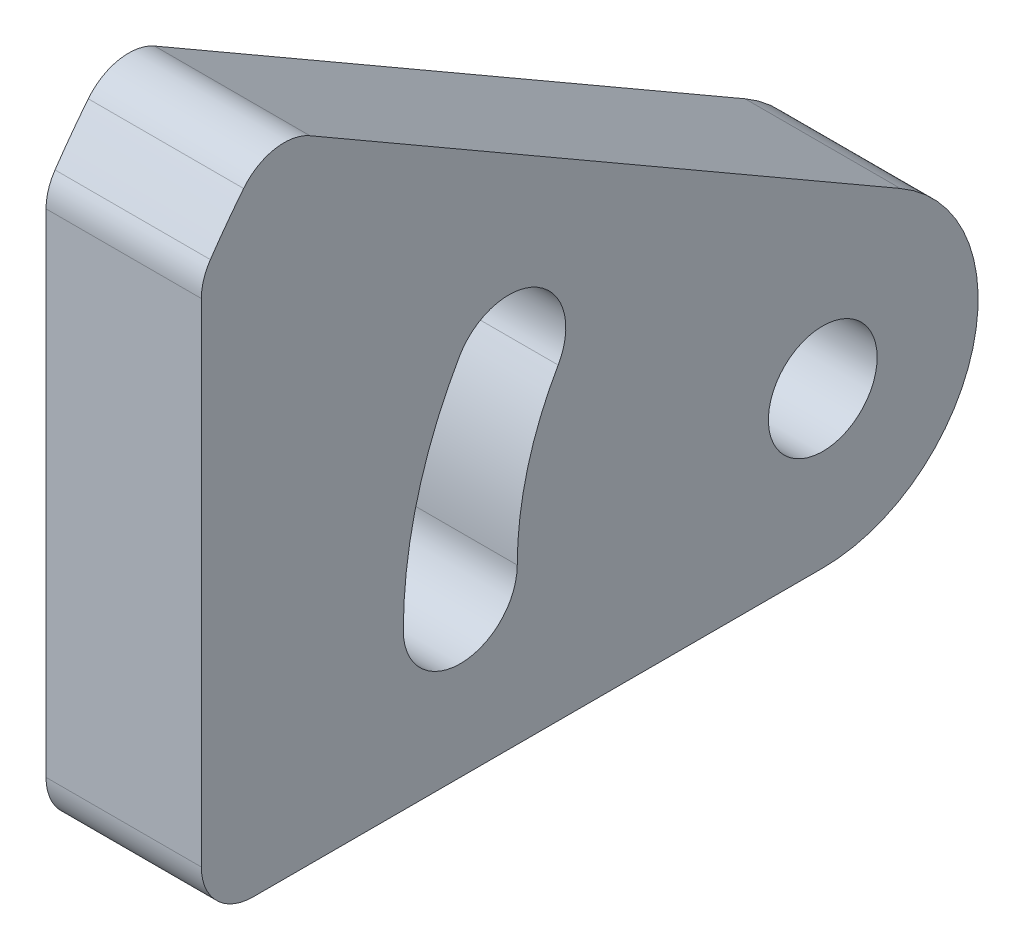
ISO-10303-21;
HEADER;
FILE_DESCRIPTION(('STEP AP214'),'2;1');
FILE_NAME('part.step','',(''),(''),'','','');
FILE_SCHEMA(('AUTOMOTIVE_DESIGN { 1 0 10303 214 1 1 1 1 }'));
ENDSEC;
DATA;
#1=APPLICATION_CONTEXT('core data for automotive mechanical design processes');
#2=APPLICATION_PROTOCOL_DEFINITION('international standard','automotive_design',2000,#1);
#3=PRODUCT_CONTEXT('',#1,'mechanical');
#4=PRODUCT('Part','Part','',(#3));
#5=PRODUCT_RELATED_PRODUCT_CATEGORY('part','',(#4));
#6=PRODUCT_DEFINITION_FORMATION('','',#4);
#7=PRODUCT_DEFINITION_CONTEXT('part definition',#1,'design');
#8=PRODUCT_DEFINITION('design','',#6,#7);
#9=PRODUCT_DEFINITION_SHAPE('','',#8);
#10=(LENGTH_UNIT() NAMED_UNIT(*) SI_UNIT(.MILLI.,.METRE.));
#11=(NAMED_UNIT(*) PLANE_ANGLE_UNIT() SI_UNIT($,.RADIAN.));
#12=(NAMED_UNIT(*) SI_UNIT($,.STERADIAN.) SOLID_ANGLE_UNIT());
#13=UNCERTAINTY_MEASURE_WITH_UNIT(LENGTH_MEASURE(1.E-05),#10,'distance_accuracy_value','');
#14=(GEOMETRIC_REPRESENTATION_CONTEXT(3) GLOBAL_UNCERTAINTY_ASSIGNED_CONTEXT((#13)) GLOBAL_UNIT_ASSIGNED_CONTEXT((#10,
#11,#12)) REPRESENTATION_CONTEXT('',''));
#15=CARTESIAN_POINT('',(0.,0.,0.));
#16=DIRECTION('',(0.,0.,1.));
#17=DIRECTION('',(1.,0.,0.));
#18=AXIS2_PLACEMENT_3D('',#15,#16,#17);
#19=CARTESIAN_POINT('',(1.5,0.,0.));
#20=DIRECTION('',(-1.,0.,0.));
#21=DIRECTION('',(0.,0.,1.));
#22=AXIS2_PLACEMENT_3D('',#19,#20,#21);
#23=CYLINDRICAL_SURFACE('',#22,14.3178210632764);
#24=CARTESIAN_POINT('',(1.5,0.,0.));
#25=DIRECTION('',(1.,0.,0.));
#26=DIRECTION('',(0.,0.,-1.));
#27=AXIS2_PLACEMENT_3D('',#24,#25,#26);
#28=CIRCLE('',#27,14.3178210632764);
#29=CARTESIAN_POINT('',(1.5,8.93983064408773,11.1838914540079));
#30=VERTEX_POINT('',#29);
#31=CARTESIAN_POINT('',(1.5,8.07134733814683,11.8259609396865));
#32=VERTEX_POINT('',#31);
#33=EDGE_CURVE('E182',#30,#32,#28,.T.);
#34=ORIENTED_EDGE('',*,*,#33,.F.);
#35=DIRECTION('',(-1.,0.,0.));
#36=VECTOR('',#35,1.);
#37=CARTESIAN_POINT('',(1.5,8.93983064408773,11.1838914540079));
#38=LINE('',#37,#36);
#39=CARTESIAN_POINT('',(-1.5,8.93983064408773,11.1838914540079));
#40=VERTEX_POINT('',#39);
#41=EDGE_CURVE('E204',#30,#40,#38,.T.);
#42=ORIENTED_EDGE('',*,*,#41,.T.);
#43=CARTESIAN_POINT('',(-1.5,0.,0.));
#44=DIRECTION('',(1.,0.,0.));
#45=DIRECTION('',(0.,0.,-1.));
#46=AXIS2_PLACEMENT_3D('',#43,#44,#45);
#47=CIRCLE('',#46,14.3178210632764);
#48=CARTESIAN_POINT('',(-1.5,8.07134733814683,11.8259609396865));
#49=VERTEX_POINT('',#48);
#50=EDGE_CURVE('E192',#40,#49,#47,.T.);
#51=ORIENTED_EDGE('',*,*,#50,.T.);
#52=DIRECTION('',(-1.,0.,0.));
#53=VECTOR('',#52,1.);
#54=CARTESIAN_POINT('',(1.5,8.07134733814683,11.8259609396865));
#55=LINE('',#54,#53);
#56=EDGE_CURVE('E201',#49,#32,#55,.F.);
#57=ORIENTED_EDGE('',*,*,#56,.T.);
#58=EDGE_LOOP('',(#34,#42,#51,#57));
#59=FACE_BOUND('',#58,.T.);
#60=ADVANCED_FACE('F33',(#59),#23,.T.);
#61=CARTESIAN_POINT('',(1.5,0.,0.));
#62=DIRECTION('',(1.,0.,0.));
#63=DIRECTION('',(0.,0.,-1.));
#64=AXIS2_PLACEMENT_3D('',#61,#62,#63);
#65=PLANE('',#64);
#66=CARTESIAN_POINT('',(1.5,3.5,6.06217782649107));
#67=DIRECTION('',(1.,0.,0.));
#68=DIRECTION('',(0.,0.,-1.));
#69=AXIS2_PLACEMENT_3D('',#66,#67,#68);
#70=CIRCLE('',#69,1.1);
#71=CARTESIAN_POINT('',(1.5,2.95,5.10954988232819));
#72=VERTEX_POINT('',#71);
#73=CARTESIAN_POINT('',(1.5,4.05,7.01480577065395));
#74=VERTEX_POINT('',#73);
#75=EDGE_CURVE('E127',#72,#74,#70,.T.);
#76=ORIENTED_EDGE('',*,*,#75,.F.);
#77=CARTESIAN_POINT('',(1.5,0.,0.));
#78=DIRECTION('',(-1.,0.,0.));
#79=DIRECTION('',(0.,0.,-1.));
#80=AXIS2_PLACEMENT_3D('',#77,#78,#79);
#81=CIRCLE('',#80,5.9);
#82=CARTESIAN_POINT('',(1.5,0.,5.9));
#83=VERTEX_POINT('',#82);
#84=EDGE_CURVE('E145',#83,#72,#81,.T.);
#85=ORIENTED_EDGE('',*,*,#84,.F.);
#86=CARTESIAN_POINT('',(1.5,0.,7.));
#87=DIRECTION('',(1.,0.,0.));
#88=DIRECTION('',(0.,0.,-1.));
#89=AXIS2_PLACEMENT_3D('',#86,#87,#88);
#90=CIRCLE('',#89,1.1);
#91=CARTESIAN_POINT('',(1.5,0.,8.1));
#92=VERTEX_POINT('',#91);
#93=EDGE_CURVE('E148',#92,#83,#90,.T.);
#94=ORIENTED_EDGE('',*,*,#93,.F.);
#95=CARTESIAN_POINT('',(1.5,0.,0.));
#96=DIRECTION('',(1.,0.,0.));
#97=DIRECTION('',(0.,0.,-1.));
#98=AXIS2_PLACEMENT_3D('',#95,#96,#97);
#99=CIRCLE('',#98,8.1);
#100=EDGE_CURVE('E154',#74,#92,#99,.T.);
#101=ORIENTED_EDGE('',*,*,#100,.F.);
#102=EDGE_LOOP('',(#76,#85,#94,#101));
#103=FACE_BOUND('',#102,.T.);
#104=DIRECTION('',(0.,0.500000000000001,0.866025403784438));
#105=VECTOR('',#104,1.);
#106=CARTESIAN_POINT('',(1.5,2.59807621135331,-1.5));
#107=LINE('',#106,#105);
#108=CARTESIAN_POINT('',(1.5,2.59807621135331,-1.5));
#109=VERTEX_POINT('',#108);
#110=CARTESIAN_POINT('',(1.5,9.18147119178415,9.9027745924001));
#111=VERTEX_POINT('',#110);
#112=EDGE_CURVE('E178',#109,#111,#107,.T.);
#113=ORIENTED_EDGE('',*,*,#112,.T.);
#114=CARTESIAN_POINT('',(1.5,8.31544578799972,10.4027745924001));
#115=DIRECTION('',(1.,0.,0.));
#116=DIRECTION('',(0.,0.,-1.));
#117=AXIS2_PLACEMENT_3D('',#114,#115,#116);
#118=CIRCLE('',#117,1.);
#119=EDGE_CURVE('E217',#111,#30,#118,.T.);
#120=ORIENTED_EDGE('',*,*,#119,.T.);
#121=ORIENTED_EDGE('',*,*,#33,.T.);
#122=CARTESIAN_POINT('',(1.5,7.50761998728274,11.));
#123=DIRECTION('',(1.,0.,0.));
#124=DIRECTION('',(0.,0.,-1.));
#125=AXIS2_PLACEMENT_3D('',#122,#123,#124);
#126=CIRCLE('',#125,1.);
#127=CARTESIAN_POINT('',(1.5,7.50761998728274,12.));
#128=VERTEX_POINT('',#127);
#129=EDGE_CURVE('E54',#32,#128,#126,.T.);
#130=ORIENTED_EDGE('',*,*,#129,.T.);
#131=DIRECTION('',(0.,1.,0.));
#132=VECTOR('',#131,1.);
#133=CARTESIAN_POINT('',(1.5,7.81024967590666,12.));
#134=LINE('',#133,#132);
#135=CARTESIAN_POINT('',(1.5,-2.,12.));
#136=VERTEX_POINT('',#135);
#137=EDGE_CURVE('E160',#136,#128,#134,.T.);
#138=ORIENTED_EDGE('',*,*,#137,.F.);
#139=CARTESIAN_POINT('',(1.5,-2.,11.));
#140=DIRECTION('',(1.,0.,0.));
#141=DIRECTION('',(0.,0.,-1.));
#142=AXIS2_PLACEMENT_3D('',#139,#140,#141);
#143=CIRCLE('',#142,1.);
#144=CARTESIAN_POINT('',(1.5,-3.,11.));
#145=VERTEX_POINT('',#144);
#146=EDGE_CURVE('E48',#136,#145,#143,.T.);
#147=ORIENTED_EDGE('',*,*,#146,.T.);
#148=DIRECTION('',(0.,0.,-1.));
#149=VECTOR('',#148,1.);
#150=CARTESIAN_POINT('',(1.5,-3.,0.));
#151=LINE('',#150,#149);
#152=CARTESIAN_POINT('',(1.5,-3.,0.));
#153=VERTEX_POINT('',#152);
#154=EDGE_CURVE('E184',#145,#153,#151,.T.);
#155=ORIENTED_EDGE('',*,*,#154,.T.);
#156=CARTESIAN_POINT('',(1.5,0.,0.));
#157=DIRECTION('',(1.,0.,0.));
#158=DIRECTION('',(0.,0.,-1.));
#159=AXIS2_PLACEMENT_3D('',#156,#157,#158);
#160=CIRCLE('',#159,3.);
#161=EDGE_CURVE('E175',#153,#109,#160,.T.);
#162=ORIENTED_EDGE('',*,*,#161,.T.);
#163=EDGE_LOOP('',(#113,#120,#121,#130,#138,#147,#155,#162));
#164=FACE_BOUND('',#163,.T.);
#165=CARTESIAN_POINT('',(1.5,0.,0.));
#166=DIRECTION('',(1.,0.,0.));
#167=DIRECTION('',(0.,0.,-1.));
#168=AXIS2_PLACEMENT_3D('',#165,#166,#167);
#169=CIRCLE('',#168,1.05);
#170=CARTESIAN_POINT('',(1.5,0.,-1.05));
#171=VERTEX_POINT('',#170);
#172=EDGE_CURVE('E169',#171,#171,#169,.T.);
#173=ORIENTED_EDGE('',*,*,#172,.F.);
#174=EDGE_LOOP('',(#173));
#175=FACE_BOUND('',#174,.T.);
#176=ADVANCED_FACE('F237',(#103,#164,#175),#65,.T.);
#177=CARTESIAN_POINT('',(-1.5,0.,0.));
#178=DIRECTION('',(1.,0.,0.));
#179=DIRECTION('',(0.,0.,-1.));
#180=AXIS2_PLACEMENT_3D('',#177,#178,#179);
#181=PLANE('',#180);
#182=CARTESIAN_POINT('',(-1.5,0.,0.));
#183=DIRECTION('',(-1.,0.,0.));
#184=DIRECTION('',(0.,0.,-1.));
#185=AXIS2_PLACEMENT_3D('',#182,#183,#184);
#186=CIRCLE('',#185,5.9);
#187=CARTESIAN_POINT('',(-1.5,0.,5.9));
#188=VERTEX_POINT('',#187);
#189=CARTESIAN_POINT('',(-1.5,2.95,5.10954988232819));
#190=VERTEX_POINT('',#189);
#191=EDGE_CURVE('E132',#188,#190,#186,.T.);
#192=ORIENTED_EDGE('',*,*,#191,.T.);
#193=CARTESIAN_POINT('',(-1.5,3.5,6.06217782649107));
#194=DIRECTION('',(1.,0.,0.));
#195=DIRECTION('',(0.,0.,-1.));
#196=AXIS2_PLACEMENT_3D('',#193,#194,#195);
#197=CIRCLE('',#196,1.1);
#198=CARTESIAN_POINT('',(-1.5,4.05,7.01480577065395));
#199=VERTEX_POINT('',#198);
#200=EDGE_CURVE('E124',#190,#199,#197,.T.);
#201=ORIENTED_EDGE('',*,*,#200,.T.);
#202=CARTESIAN_POINT('',(-1.5,0.,0.));
#203=DIRECTION('',(1.,0.,0.));
#204=DIRECTION('',(0.,0.,-1.));
#205=AXIS2_PLACEMENT_3D('',#202,#203,#204);
#206=CIRCLE('',#205,8.1);
#207=CARTESIAN_POINT('',(-1.5,0.,8.1));
#208=VERTEX_POINT('',#207);
#209=EDGE_CURVE('E136',#199,#208,#206,.T.);
#210=ORIENTED_EDGE('',*,*,#209,.T.);
#211=CARTESIAN_POINT('',(-1.5,0.,7.));
#212=DIRECTION('',(1.,0.,0.));
#213=DIRECTION('',(0.,0.,-1.));
#214=AXIS2_PLACEMENT_3D('',#211,#212,#213);
#215=CIRCLE('',#214,1.1);
#216=EDGE_CURVE('E140',#208,#188,#215,.T.);
#217=ORIENTED_EDGE('',*,*,#216,.T.);
#218=EDGE_LOOP('',(#192,#201,#210,#217));
#219=FACE_BOUND('',#218,.T.);
#220=ORIENTED_EDGE('',*,*,#50,.F.);
#221=CARTESIAN_POINT('',(-1.5,8.31544578799972,10.4027745924001));
#222=DIRECTION('',(1.,0.,0.));
#223=DIRECTION('',(0.,0.,-1.));
#224=AXIS2_PLACEMENT_3D('',#221,#222,#223);
#225=CIRCLE('',#224,1.);
#226=CARTESIAN_POINT('',(-1.5,9.18147119178415,9.9027745924001));
#227=VERTEX_POINT('',#226);
#228=EDGE_CURVE('E211',#40,#227,#225,.F.);
#229=ORIENTED_EDGE('',*,*,#228,.T.);
#230=DIRECTION('',(0.,0.500000000000001,0.866025403784438));
#231=VECTOR('',#230,1.);
#232=CARTESIAN_POINT('',(-1.5,2.59807621135331,-1.5));
#233=LINE('',#232,#231);
#234=CARTESIAN_POINT('',(-1.5,2.59807621135331,-1.5));
#235=VERTEX_POINT('',#234);
#236=EDGE_CURVE('E189',#235,#227,#233,.T.);
#237=ORIENTED_EDGE('',*,*,#236,.F.);
#238=CARTESIAN_POINT('',(-1.5,0.,0.));
#239=DIRECTION('',(1.,0.,0.));
#240=DIRECTION('',(0.,0.,-1.));
#241=AXIS2_PLACEMENT_3D('',#238,#239,#240);
#242=CIRCLE('',#241,3.);
#243=CARTESIAN_POINT('',(-1.5,-3.,0.));
#244=VERTEX_POINT('',#243);
#245=EDGE_CURVE('E172',#244,#235,#242,.T.);
#246=ORIENTED_EDGE('',*,*,#245,.F.);
#247=DIRECTION('',(0.,0.,-1.));
#248=VECTOR('',#247,1.);
#249=CARTESIAN_POINT('',(-1.5,-3.,0.));
#250=LINE('',#249,#248);
#251=CARTESIAN_POINT('',(-1.5,-3.,11.));
#252=VERTEX_POINT('',#251);
#253=EDGE_CURVE('E179',#252,#244,#250,.T.);
#254=ORIENTED_EDGE('',*,*,#253,.F.);
#255=CARTESIAN_POINT('',(-1.5,-2.,11.));
#256=DIRECTION('',(1.,0.,0.));
#257=DIRECTION('',(0.,0.,-1.));
#258=AXIS2_PLACEMENT_3D('',#255,#256,#257);
#259=CIRCLE('',#258,1.);
#260=CARTESIAN_POINT('',(-1.5,-2.,12.));
#261=VERTEX_POINT('',#260);
#262=EDGE_CURVE('E207',#252,#261,#259,.F.);
#263=ORIENTED_EDGE('',*,*,#262,.T.);
#264=DIRECTION('',(0.,1.,0.));
#265=VECTOR('',#264,1.);
#266=CARTESIAN_POINT('',(-1.5,7.81024967590666,12.));
#267=LINE('',#266,#265);
#268=CARTESIAN_POINT('',(-1.5,7.50761998728274,12.));
#269=VERTEX_POINT('',#268);
#270=EDGE_CURVE('E164',#261,#269,#267,.T.);
#271=ORIENTED_EDGE('',*,*,#270,.T.);
#272=CARTESIAN_POINT('',(-1.5,7.50761998728274,11.));
#273=DIRECTION('',(1.,0.,0.));
#274=DIRECTION('',(0.,0.,-1.));
#275=AXIS2_PLACEMENT_3D('',#272,#273,#274);
#276=CIRCLE('',#275,1.);
#277=EDGE_CURVE('E209',#269,#49,#276,.F.);
#278=ORIENTED_EDGE('',*,*,#277,.T.);
#279=EDGE_LOOP('',(#220,#229,#237,#246,#254,#263,#271,#278));
#280=FACE_BOUND('',#279,.T.);
#281=CARTESIAN_POINT('',(-1.5,0.,0.));
#282=DIRECTION('',(1.,0.,0.));
#283=DIRECTION('',(0.,0.,-1.));
#284=AXIS2_PLACEMENT_3D('',#281,#282,#283);
#285=CIRCLE('',#284,1.05);
#286=CARTESIAN_POINT('',(-1.5,0.,-1.05));
#287=VERTEX_POINT('',#286);
#288=EDGE_CURVE('E167',#287,#287,#285,.T.);
#289=ORIENTED_EDGE('',*,*,#288,.T.);
#290=EDGE_LOOP('',(#289));
#291=FACE_BOUND('',#290,.T.);
#292=ADVANCED_FACE('F142',(#219,#280,#291),#181,.F.);
#293=CARTESIAN_POINT('',(1.5,0.,0.));
#294=DIRECTION('',(-1.,0.,0.));
#295=DIRECTION('',(0.,0.,1.));
#296=AXIS2_PLACEMENT_3D('',#293,#294,#295);
#297=CYLINDRICAL_SURFACE('',#296,3.);
#298=ORIENTED_EDGE('',*,*,#245,.T.);
#299=DIRECTION('',(-1.,0.,0.));
#300=VECTOR('',#299,1.);
#301=CARTESIAN_POINT('',(1.5,2.59807621135331,-1.5));
#302=LINE('',#301,#300);
#303=EDGE_CURVE('E198',#109,#235,#302,.T.);
#304=ORIENTED_EDGE('',*,*,#303,.F.);
#305=ORIENTED_EDGE('',*,*,#161,.F.);
#306=DIRECTION('',(-1.,0.,0.));
#307=VECTOR('',#306,1.);
#308=CARTESIAN_POINT('',(1.5,-3.,0.));
#309=LINE('',#308,#307);
#310=EDGE_CURVE('E186',#153,#244,#309,.T.);
#311=ORIENTED_EDGE('',*,*,#310,.T.);
#312=EDGE_LOOP('',(#298,#304,#305,#311));
#313=FACE_BOUND('',#312,.T.);
#314=ADVANCED_FACE('F249',(#313),#297,.T.);
#315=CARTESIAN_POINT('',(1.5,2.59807621135331,-1.5));
#316=DIRECTION('',(0.,-0.866025403784438,0.500000000000001));
#317=DIRECTION('',(0.,-0.500000000000001,-0.866025403784438));
#318=AXIS2_PLACEMENT_3D('',#315,#316,#317);
#319=PLANE('',#318);
#320=ORIENTED_EDGE('',*,*,#236,.T.);
#321=DIRECTION('',(-1.,0.,0.));
#322=VECTOR('',#321,1.);
#323=CARTESIAN_POINT('',(1.5,9.18147119178415,9.9027745924001));
#324=LINE('',#323,#322);
#325=EDGE_CURVE('E213',#227,#111,#324,.F.);
#326=ORIENTED_EDGE('',*,*,#325,.T.);
#327=ORIENTED_EDGE('',*,*,#112,.F.);
#328=ORIENTED_EDGE('',*,*,#303,.T.);
#329=EDGE_LOOP('',(#320,#326,#327,#328));
#330=FACE_BOUND('',#329,.T.);
#331=ADVANCED_FACE('F245',(#330),#319,.F.);
#332=CARTESIAN_POINT('',(1.5,-3.,0.));
#333=DIRECTION('',(0.,1.,0.));
#334=DIRECTION('',(0.,0.,1.));
#335=AXIS2_PLACEMENT_3D('',#332,#333,#334);
#336=PLANE('',#335);
#337=ORIENTED_EDGE('',*,*,#154,.F.);
#338=DIRECTION('',(1.,0.,0.));
#339=VECTOR('',#338,1.);
#340=CARTESIAN_POINT('',(1.5,-3.,11.));
#341=LINE('',#340,#339);
#342=EDGE_CURVE('E11',#145,#252,#341,.F.);
#343=ORIENTED_EDGE('',*,*,#342,.T.);
#344=ORIENTED_EDGE('',*,*,#253,.T.);
#345=ORIENTED_EDGE('',*,*,#310,.F.);
#346=EDGE_LOOP('',(#337,#343,#344,#345));
#347=FACE_BOUND('',#346,.T.);
#348=ADVANCED_FACE('F254',(#347),#336,.F.);
#349=CARTESIAN_POINT('',(1.5,0.,0.));
#350=DIRECTION('',(-1.,0.,0.));
#351=DIRECTION('',(0.,0.,1.));
#352=AXIS2_PLACEMENT_3D('',#349,#350,#351);
#353=CYLINDRICAL_SURFACE('',#352,1.05);
#354=ORIENTED_EDGE('',*,*,#172,.T.);
#355=EDGE_LOOP('',(#354));
#356=FACE_BOUND('',#355,.T.);
#357=ORIENTED_EDGE('',*,*,#288,.F.);
#358=EDGE_LOOP('',(#357));
#359=FACE_BOUND('',#358,.T.);
#360=ADVANCED_FACE('F256',(#356,#359),#353,.F.);
#361=CARTESIAN_POINT('',(-1.5,7.81024967590666,12.));
#362=DIRECTION('',(0.,0.,-1.));
#363=DIRECTION('',(-1.,0.,0.));
#364=AXIS2_PLACEMENT_3D('',#361,#362,#363);
#365=PLANE('',#364);
#366=ORIENTED_EDGE('',*,*,#137,.T.);
#367=DIRECTION('',(-1.,0.,0.));
#368=VECTOR('',#367,1.);
#369=CARTESIAN_POINT('',(-1.5,7.50761998728274,12.));
#370=LINE('',#369,#368);
#371=EDGE_CURVE('E41',#128,#269,#370,.T.);
#372=ORIENTED_EDGE('',*,*,#371,.T.);
#373=ORIENTED_EDGE('',*,*,#270,.F.);
#374=DIRECTION('',(1.,0.,0.));
#375=VECTOR('',#374,1.);
#376=CARTESIAN_POINT('',(-1.5,-2.,12.));
#377=LINE('',#376,#375);
#378=EDGE_CURVE('E219',#261,#136,#377,.T.);
#379=ORIENTED_EDGE('',*,*,#378,.T.);
#380=EDGE_LOOP('',(#366,#372,#373,#379));
#381=FACE_BOUND('',#380,.T.);
#382=ADVANCED_FACE('F224',(#381),#365,.F.);
#383=CARTESIAN_POINT('',(-1.5,3.5,6.06217782649107));
#384=DIRECTION('',(1.,0.,0.));
#385=DIRECTION('',(0.,0.,-1.));
#386=AXIS2_PLACEMENT_3D('',#383,#384,#385);
#387=CYLINDRICAL_SURFACE('',#386,1.1);
#388=ORIENTED_EDGE('',*,*,#75,.T.);
#389=DIRECTION('',(1.,0.,0.));
#390=VECTOR('',#389,1.);
#391=CARTESIAN_POINT('',(-1.5,4.05,7.01480577065395));
#392=LINE('',#391,#390);
#393=EDGE_CURVE('E120',#199,#74,#392,.T.);
#394=ORIENTED_EDGE('',*,*,#393,.F.);
#395=ORIENTED_EDGE('',*,*,#200,.F.);
#396=DIRECTION('',(1.,0.,0.));
#397=VECTOR('',#396,1.);
#398=CARTESIAN_POINT('',(-1.5,2.95,5.10954988232819));
#399=LINE('',#398,#397);
#400=EDGE_CURVE('E158',#190,#72,#399,.T.);
#401=ORIENTED_EDGE('',*,*,#400,.T.);
#402=EDGE_LOOP('',(#388,#394,#395,#401));
#403=FACE_BOUND('',#402,.T.);
#404=ADVANCED_FACE('F122',(#403),#387,.F.);
#405=CARTESIAN_POINT('',(-1.5,0.,0.));
#406=DIRECTION('',(1.,0.,0.));
#407=DIRECTION('',(0.,0.,-1.));
#408=AXIS2_PLACEMENT_3D('',#405,#406,#407);
#409=CYLINDRICAL_SURFACE('',#408,5.9);
#410=ORIENTED_EDGE('',*,*,#84,.T.);
#411=ORIENTED_EDGE('',*,*,#400,.F.);
#412=ORIENTED_EDGE('',*,*,#191,.F.);
#413=DIRECTION('',(1.,0.,0.));
#414=VECTOR('',#413,1.);
#415=CARTESIAN_POINT('',(-1.5,0.,5.9));
#416=LINE('',#415,#414);
#417=EDGE_CURVE('E161',#188,#83,#416,.T.);
#418=ORIENTED_EDGE('',*,*,#417,.T.);
#419=EDGE_LOOP('',(#410,#411,#412,#418));
#420=FACE_BOUND('',#419,.T.);
#421=ADVANCED_FACE('F316',(#420),#409,.T.);
#422=CARTESIAN_POINT('',(-1.5,0.,7.));
#423=DIRECTION('',(1.,0.,0.));
#424=DIRECTION('',(0.,0.,-1.));
#425=AXIS2_PLACEMENT_3D('',#422,#423,#424);
#426=CYLINDRICAL_SURFACE('',#425,1.1);
#427=ORIENTED_EDGE('',*,*,#93,.T.);
#428=ORIENTED_EDGE('',*,*,#417,.F.);
#429=ORIENTED_EDGE('',*,*,#216,.F.);
#430=DIRECTION('',(1.,0.,0.));
#431=VECTOR('',#430,1.);
#432=CARTESIAN_POINT('',(-1.5,0.,8.1));
#433=LINE('',#432,#431);
#434=EDGE_CURVE('E131',#208,#92,#433,.T.);
#435=ORIENTED_EDGE('',*,*,#434,.T.);
#436=EDGE_LOOP('',(#427,#428,#429,#435));
#437=FACE_BOUND('',#436,.T.);
#438=ADVANCED_FACE('F322',(#437),#426,.F.);
#439=CARTESIAN_POINT('',(-1.5,0.,0.));
#440=DIRECTION('',(1.,0.,0.));
#441=DIRECTION('',(0.,0.,-1.));
#442=AXIS2_PLACEMENT_3D('',#439,#440,#441);
#443=CYLINDRICAL_SURFACE('',#442,8.1);
#444=ORIENTED_EDGE('',*,*,#100,.T.);
#445=ORIENTED_EDGE('',*,*,#434,.F.);
#446=ORIENTED_EDGE('',*,*,#209,.F.);
#447=ORIENTED_EDGE('',*,*,#393,.T.);
#448=EDGE_LOOP('',(#444,#445,#446,#447));
#449=FACE_BOUND('',#448,.T.);
#450=ADVANCED_FACE('F137',(#449),#443,.F.);
#451=CARTESIAN_POINT('',(1.5,8.31544578799972,10.4027745924001));
#452=DIRECTION('',(-1.,0.,0.));
#453=DIRECTION('',(0.,0.,1.));
#454=AXIS2_PLACEMENT_3D('',#451,#452,#453);
#455=CYLINDRICAL_SURFACE('',#454,1.);
#456=ORIENTED_EDGE('',*,*,#119,.F.);
#457=ORIENTED_EDGE('',*,*,#325,.F.);
#458=ORIENTED_EDGE('',*,*,#228,.F.);
#459=ORIENTED_EDGE('',*,*,#41,.F.);
#460=EDGE_LOOP('',(#456,#457,#458,#459));
#461=FACE_BOUND('',#460,.T.);
#462=ADVANCED_FACE('F242',(#461),#455,.T.);
#463=CARTESIAN_POINT('',(1.5,7.50761998728274,11.));
#464=DIRECTION('',(-1.,0.,0.));
#465=DIRECTION('',(0.,0.,1.));
#466=AXIS2_PLACEMENT_3D('',#463,#464,#465);
#467=CYLINDRICAL_SURFACE('',#466,1.);
#468=ORIENTED_EDGE('',*,*,#277,.F.);
#469=ORIENTED_EDGE('',*,*,#371,.F.);
#470=ORIENTED_EDGE('',*,*,#129,.F.);
#471=ORIENTED_EDGE('',*,*,#56,.F.);
#472=EDGE_LOOP('',(#468,#469,#470,#471));
#473=FACE_BOUND('',#472,.T.);
#474=ADVANCED_FACE('F233',(#473),#467,.T.);
#475=CARTESIAN_POINT('',(-1.5,-2.,11.));
#476=DIRECTION('',(1.,0.,0.));
#477=DIRECTION('',(0.,0.,-1.));
#478=AXIS2_PLACEMENT_3D('',#475,#476,#477);
#479=CYLINDRICAL_SURFACE('',#478,1.);
#480=ORIENTED_EDGE('',*,*,#262,.F.);
#481=ORIENTED_EDGE('',*,*,#342,.F.);
#482=ORIENTED_EDGE('',*,*,#146,.F.);
#483=ORIENTED_EDGE('',*,*,#378,.F.);
#484=EDGE_LOOP('',(#480,#481,#482,#483));
#485=FACE_BOUND('',#484,.T.);
#486=ADVANCED_FACE('F35',(#485),#479,.T.);
#487=CLOSED_SHELL('',(#60,#176,#292,#314,#331,#348,#360,#382,#404,#421,#438,#450,#462,#474,#486));
#488=MANIFOLD_SOLID_BREP('B2',#487);
#489=ADVANCED_BREP_SHAPE_REPRESENTATION('',(#18,#488),#14);
#490=SHAPE_DEFINITION_REPRESENTATION(#9,#489);
ENDSEC;
END-ISO-10303-21;
